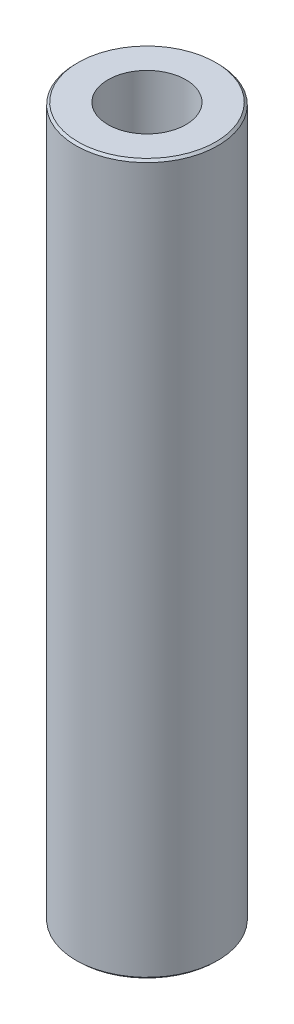
ISO-10303-21;
HEADER;
FILE_DESCRIPTION(('STEP AP214'),'2;1');
FILE_NAME('part.step','',(''),(''),'','','');
FILE_SCHEMA(('AUTOMOTIVE_DESIGN { 1 0 10303 214 1 1 1 1 }'));
ENDSEC;
DATA;
#1=APPLICATION_CONTEXT('core data for automotive mechanical design processes');
#2=APPLICATION_PROTOCOL_DEFINITION('international standard','automotive_design',2000,#1);
#3=PRODUCT_CONTEXT('',#1,'mechanical');
#4=PRODUCT('Part','Part','',(#3));
#5=PRODUCT_RELATED_PRODUCT_CATEGORY('part','',(#4));
#6=PRODUCT_DEFINITION_FORMATION('','',#4);
#7=PRODUCT_DEFINITION_CONTEXT('part definition',#1,'design');
#8=PRODUCT_DEFINITION('design','',#6,#7);
#9=PRODUCT_DEFINITION_SHAPE('','',#8);
#10=(LENGTH_UNIT() NAMED_UNIT(*) SI_UNIT(.MILLI.,.METRE.));
#11=(NAMED_UNIT(*) PLANE_ANGLE_UNIT() SI_UNIT($,.RADIAN.));
#12=(NAMED_UNIT(*) SI_UNIT($,.STERADIAN.) SOLID_ANGLE_UNIT());
#13=UNCERTAINTY_MEASURE_WITH_UNIT(LENGTH_MEASURE(1.E-05),#10,'distance_accuracy_value','');
#14=(GEOMETRIC_REPRESENTATION_CONTEXT(3) GLOBAL_UNCERTAINTY_ASSIGNED_CONTEXT((#13)) GLOBAL_UNIT_ASSIGNED_CONTEXT((#10,
#11,#12)) REPRESENTATION_CONTEXT('',''));
#15=CARTESIAN_POINT('',(0.,0.,0.));
#16=DIRECTION('',(0.,0.,1.));
#17=DIRECTION('',(1.,0.,0.));
#18=AXIS2_PLACEMENT_3D('',#15,#16,#17);
#19=CARTESIAN_POINT('',(0.,600.,0.));
#20=DIRECTION('',(0.,-1.,0.));
#21=DIRECTION('',(0.,0.,-1.));
#22=AXIS2_PLACEMENT_3D('',#19,#20,#21);
#23=CYLINDRICAL_SURFACE('',#22,60.);
#24=CARTESIAN_POINT('',(0.,598.143654109351,0.));
#25=DIRECTION('',(0.,1.,0.));
#26=DIRECTION('',(0.,0.,1.));
#27=AXIS2_PLACEMENT_3D('',#24,#25,#26);
#28=CIRCLE('',#27,60.);
#29=CARTESIAN_POINT('',(0.,598.143654109351,60.));
#30=VERTEX_POINT('',#29);
#31=EDGE_CURVE('E50',#30,#30,#28,.F.);
#32=ORIENTED_EDGE('',*,*,#31,.T.);
#33=EDGE_LOOP('',(#32));
#34=FACE_BOUND('',#33,.T.);
#35=CARTESIAN_POINT('',(0.,1.82805181902357,0.));
#36=DIRECTION('',(0.,1.,0.));
#37=DIRECTION('',(0.,0.,1.));
#38=AXIS2_PLACEMENT_3D('',#35,#36,#37);
#39=CIRCLE('',#38,60.);
#40=CARTESIAN_POINT('',(0.,1.82805181902357,60.));
#41=VERTEX_POINT('',#40);
#42=EDGE_CURVE('E51',#41,#41,#39,.T.);
#43=ORIENTED_EDGE('',*,*,#42,.T.);
#44=EDGE_LOOP('',(#43));
#45=FACE_BOUND('',#44,.T.);
#46=ADVANCED_FACE('F39',(#34,#45),#23,.T.);
#47=CARTESIAN_POINT('',(0.,600.,0.));
#48=DIRECTION('',(0.,1.,0.));
#49=DIRECTION('',(0.,0.,1.));
#50=AXIS2_PLACEMENT_3D('',#47,#48,#49);
#51=PLANE('',#50);
#52=CARTESIAN_POINT('',(0.,600.,0.));
#53=DIRECTION('',(0.,1.,0.));
#54=DIRECTION('',(0.,0.,1.));
#55=AXIS2_PLACEMENT_3D('',#52,#53,#54);
#56=CIRCLE('',#55,58.1719481809767);
#57=CARTESIAN_POINT('',(0.,600.,58.1719481809767));
#58=VERTEX_POINT('',#57);
#59=EDGE_CURVE('E54',#58,#58,#56,.T.);
#60=ORIENTED_EDGE('',*,*,#59,.T.);
#61=EDGE_LOOP('',(#60));
#62=FACE_BOUND('',#61,.T.);
#63=CARTESIAN_POINT('',(0.,600.,0.));
#64=DIRECTION('',(0.,1.,0.));
#65=DIRECTION('',(0.,0.,1.));
#66=AXIS2_PLACEMENT_3D('',#63,#64,#65);
#67=CIRCLE('',#66,32.9303043117154);
#68=CARTESIAN_POINT('',(0.,600.,32.9303043117154));
#69=VERTEX_POINT('',#68);
#70=EDGE_CURVE('E58',#69,#69,#67,.T.);
#71=ORIENTED_EDGE('',*,*,#70,.F.);
#72=EDGE_LOOP('',(#71));
#73=FACE_BOUND('',#72,.T.);
#74=ADVANCED_FACE('F69',(#62,#73),#51,.T.);
#75=CARTESIAN_POINT('',(0.,0.,0.));
#76=DIRECTION('',(0.,1.,0.));
#77=DIRECTION('',(0.,0.,1.));
#78=AXIS2_PLACEMENT_3D('',#75,#76,#77);
#79=PLANE('',#78);
#80=CARTESIAN_POINT('',(0.,0.,0.));
#81=DIRECTION('',(0.,1.,0.));
#82=DIRECTION('',(0.,0.,1.));
#83=AXIS2_PLACEMENT_3D('',#80,#81,#82);
#84=CIRCLE('',#83,58.1436541093505);
#85=CARTESIAN_POINT('',(0.,0.,58.1436541093505));
#86=VERTEX_POINT('',#85);
#87=EDGE_CURVE('E10',#86,#86,#84,.F.);
#88=ORIENTED_EDGE('',*,*,#87,.T.);
#89=EDGE_LOOP('',(#88));
#90=FACE_BOUND('',#89,.T.);
#91=CARTESIAN_POINT('',(0.,0.,0.));
#92=DIRECTION('',(0.,1.,0.));
#93=DIRECTION('',(0.,0.,1.));
#94=AXIS2_PLACEMENT_3D('',#91,#92,#93);
#95=CIRCLE('',#94,32.9303043117154);
#96=CARTESIAN_POINT('',(0.,0.,32.9303043117154));
#97=VERTEX_POINT('',#96);
#98=EDGE_CURVE('E63',#97,#97,#95,.T.);
#99=ORIENTED_EDGE('',*,*,#98,.T.);
#100=EDGE_LOOP('',(#99));
#101=FACE_BOUND('',#100,.T.);
#102=ADVANCED_FACE('F75',(#90,#101),#79,.F.);
#103=CARTESIAN_POINT('',(0.,600.,0.));
#104=DIRECTION('',(0.,-1.,0.));
#105=DIRECTION('',(0.,0.,-1.));
#106=AXIS2_PLACEMENT_3D('',#103,#104,#105);
#107=CYLINDRICAL_SURFACE('',#106,32.9303043117154);
#108=ORIENTED_EDGE('',*,*,#70,.T.);
#109=EDGE_LOOP('',(#108));
#110=FACE_BOUND('',#109,.T.);
#111=ORIENTED_EDGE('',*,*,#98,.F.);
#112=EDGE_LOOP('',(#111));
#113=FACE_BOUND('',#112,.T.);
#114=ADVANCED_FACE('F70',(#110,#113),#107,.F.);
#115=CARTESIAN_POINT('',(0.,600.,0.));
#116=DIRECTION('',(0.,-1.,0.));
#117=DIRECTION('',(0.,0.,-1.));
#118=AXIS2_PLACEMENT_3D('',#115,#116,#117);
#119=CONICAL_SURFACE('',#118,58.1719481809767,0.777718885080122);
#120=ORIENTED_EDGE('',*,*,#31,.F.);
#121=EDGE_LOOP('',(#120));
#122=FACE_BOUND('',#121,.T.);
#123=ORIENTED_EDGE('',*,*,#59,.F.);
#124=EDGE_LOOP('',(#123));
#125=FACE_BOUND('',#124,.T.);
#126=ADVANCED_FACE('F81',(#122,#125),#119,.T.);
#127=CARTESIAN_POINT('',(0.,1.82805181902357,0.));
#128=DIRECTION('',(0.,1.,0.));
#129=DIRECTION('',(0.,0.,1.));
#130=AXIS2_PLACEMENT_3D('',#127,#128,#129);
#131=CONICAL_SURFACE('',#130,60.,0.793077441714743);
#132=ORIENTED_EDGE('',*,*,#87,.F.);
#133=EDGE_LOOP('',(#132));
#134=FACE_BOUND('',#133,.T.);
#135=ORIENTED_EDGE('',*,*,#42,.F.);
#136=EDGE_LOOP('',(#135));
#137=FACE_BOUND('',#136,.T.);
#138=ADVANCED_FACE('F45',(#134,#137),#131,.T.);
#139=CLOSED_SHELL('',(#46,#74,#102,#114,#126,#138));
#140=MANIFOLD_SOLID_BREP('B2',#139);
#141=ADVANCED_BREP_SHAPE_REPRESENTATION('',(#18,#140),#14);
#142=SHAPE_DEFINITION_REPRESENTATION(#9,#141);
ENDSEC;
END-ISO-10303-21;
